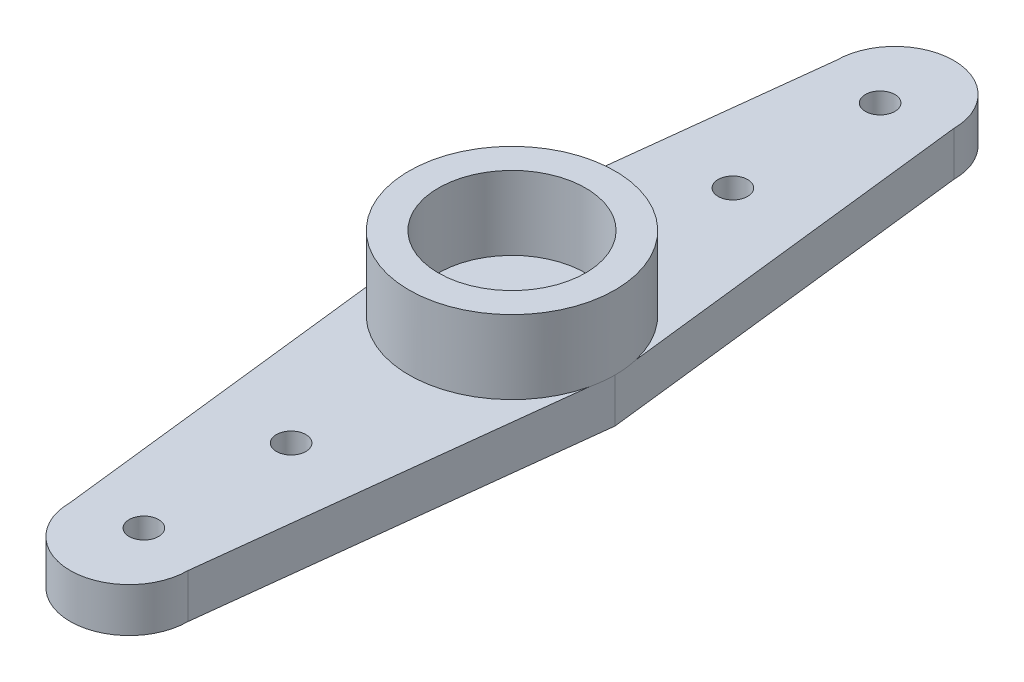
ISO-10303-21;
HEADER;
FILE_DESCRIPTION(('STEP AP214'),'2;1');
FILE_NAME('part.step','',(''),(''),'','','');
FILE_SCHEMA(('AUTOMOTIVE_DESIGN { 1 0 10303 214 1 1 1 1 }'));
ENDSEC;
DATA;
#1=APPLICATION_CONTEXT('core data for automotive mechanical design processes');
#2=APPLICATION_PROTOCOL_DEFINITION('international standard','automotive_design',2000,#1);
#3=PRODUCT_CONTEXT('',#1,'mechanical');
#4=PRODUCT('Part','Part','',(#3));
#5=PRODUCT_RELATED_PRODUCT_CATEGORY('part','',(#4));
#6=PRODUCT_DEFINITION_FORMATION('','',#4);
#7=PRODUCT_DEFINITION_CONTEXT('part definition',#1,'design');
#8=PRODUCT_DEFINITION('design','',#6,#7);
#9=PRODUCT_DEFINITION_SHAPE('','',#8);
#10=(LENGTH_UNIT() NAMED_UNIT(*) SI_UNIT(.MILLI.,.METRE.));
#11=(NAMED_UNIT(*) PLANE_ANGLE_UNIT() SI_UNIT($,.RADIAN.));
#12=(NAMED_UNIT(*) SI_UNIT($,.STERADIAN.) SOLID_ANGLE_UNIT());
#13=UNCERTAINTY_MEASURE_WITH_UNIT(LENGTH_MEASURE(1.E-05),#10,'distance_accuracy_value','');
#14=(GEOMETRIC_REPRESENTATION_CONTEXT(3) GLOBAL_UNCERTAINTY_ASSIGNED_CONTEXT((#13)) GLOBAL_UNIT_ASSIGNED_CONTEXT((#10,
#11,#12)) REPRESENTATION_CONTEXT('',''));
#15=CARTESIAN_POINT('',(0.,0.,0.));
#16=DIRECTION('',(0.,0.,1.));
#17=DIRECTION('',(1.,0.,0.));
#18=AXIS2_PLACEMENT_3D('',#15,#16,#17);
#19=CARTESIAN_POINT('',(0.,1.5,0.));
#20=DIRECTION('',(0.,1.,0.));
#21=DIRECTION('',(0.,0.,1.));
#22=AXIS2_PLACEMENT_3D('',#19,#20,#21);
#23=PLANE('',#22);
#24=CARTESIAN_POINT('',(0.,1.5,-12.5));
#25=DIRECTION('',(0.,-1.,0.));
#26=DIRECTION('',(0.,0.,-1.));
#27=AXIS2_PLACEMENT_3D('',#24,#25,#26);
#28=CIRCLE('',#27,0.500000000000001);
#29=CARTESIAN_POINT('',(0.,1.5,-13.));
#30=VERTEX_POINT('',#29);
#31=EDGE_CURVE('E162',#30,#30,#28,.T.);
#32=ORIENTED_EDGE('',*,*,#31,.T.);
#33=EDGE_LOOP('',(#32));
#34=FACE_BOUND('',#33,.T.);
#35=CARTESIAN_POINT('',(0.,1.5,-7.5));
#36=DIRECTION('',(0.,-1.,0.));
#37=DIRECTION('',(0.,0.,-1.));
#38=AXIS2_PLACEMENT_3D('',#35,#36,#37);
#39=CIRCLE('',#38,0.500000000000001);
#40=CARTESIAN_POINT('',(0.,1.5,-8.));
#41=VERTEX_POINT('',#40);
#42=EDGE_CURVE('E156',#41,#41,#39,.T.);
#43=ORIENTED_EDGE('',*,*,#42,.T.);
#44=EDGE_LOOP('',(#43));
#45=FACE_BOUND('',#44,.T.);
#46=CARTESIAN_POINT('',(0.,1.5,0.));
#47=DIRECTION('',(0.,1.,0.));
#48=DIRECTION('',(0.,0.,1.));
#49=AXIS2_PLACEMENT_3D('',#46,#47,#48);
#50=CIRCLE('',#49,3.5);
#51=CARTESIAN_POINT('',(3.40802919708029,1.5,-0.797080291970805));
#52=VERTEX_POINT('',#51);
#53=CARTESIAN_POINT('',(-3.40802919708029,1.5,-0.797080291970805));
#54=VERTEX_POINT('',#53);
#55=EDGE_CURVE('E11',#52,#54,#50,.T.);
#56=ORIENTED_EDGE('',*,*,#55,.F.);
#57=DIRECTION('',(-0.114624107985131,0.,-0.993408935871131));
#58=VECTOR('',#57,1.);
#59=CARTESIAN_POINT('',(3.45401459854015,1.5,-0.398540145985401));
#60=LINE('',#59,#58);
#61=CARTESIAN_POINT('',(2.,1.5,-13.));
#62=VERTEX_POINT('',#61);
#63=EDGE_CURVE('E218',#52,#62,#60,.T.);
#64=ORIENTED_EDGE('',*,*,#63,.T.);
#65=CARTESIAN_POINT('',(0.,1.5,-13.));
#66=DIRECTION('',(0.,1.,0.));
#67=DIRECTION('',(0.,0.,1.));
#68=AXIS2_PLACEMENT_3D('',#65,#66,#67);
#69=CIRCLE('',#68,2.);
#70=CARTESIAN_POINT('',(-2.,1.5,-13.));
#71=VERTEX_POINT('',#70);
#72=EDGE_CURVE('E238',#62,#71,#69,.T.);
#73=ORIENTED_EDGE('',*,*,#72,.T.);
#74=DIRECTION('',(-0.114624107985131,0.,0.993408935871131));
#75=VECTOR('',#74,1.);
#76=CARTESIAN_POINT('',(-3.45401459854015,1.5,-0.398540145985401));
#77=LINE('',#76,#75);
#78=EDGE_CURVE('E245',#71,#54,#77,.T.);
#79=ORIENTED_EDGE('',*,*,#78,.T.);
#80=EDGE_LOOP('',(#56,#64,#73,#79));
#81=FACE_BOUND('',#80,.T.);
#82=ADVANCED_FACE('F36',(#34,#45,#81),#23,.T.);
#83=CARTESIAN_POINT('',(3.45401459854015,1.5,-0.398540145985401));
#84=DIRECTION('',(-0.993408935871131,0.,0.114624107985131));
#85=DIRECTION('',(0.114624107985131,0.,0.993408935871131));
#86=AXIS2_PLACEMENT_3D('',#83,#84,#85);
#87=PLANE('',#86);
#88=DIRECTION('',(-0.114624107985131,0.,-0.993408935871131));
#89=VECTOR('',#88,1.);
#90=CARTESIAN_POINT('',(3.45401459854015,0.,-0.398540145985401));
#91=LINE('',#90,#89);
#92=CARTESIAN_POINT('',(3.5,0.,0.));
#93=VERTEX_POINT('',#92);
#94=CARTESIAN_POINT('',(2.,0.,-13.));
#95=VERTEX_POINT('',#94);
#96=EDGE_CURVE('E133',#93,#95,#91,.T.);
#97=ORIENTED_EDGE('',*,*,#96,.T.);
#98=DIRECTION('',(0.,-1.,0.));
#99=VECTOR('',#98,1.);
#100=CARTESIAN_POINT('',(2.,1.5,-13.));
#101=LINE('',#100,#99);
#102=EDGE_CURVE('E40',#62,#95,#101,.T.);
#103=ORIENTED_EDGE('',*,*,#102,.F.);
#104=ORIENTED_EDGE('',*,*,#63,.F.);
#105=CARTESIAN_POINT('',(3.5,1.5,0.));
#106=VERTEX_POINT('',#105);
#107=EDGE_CURVE('E221',#106,#52,#60,.T.);
#108=ORIENTED_EDGE('',*,*,#107,.F.);
#109=DIRECTION('',(0.,-1.,0.));
#110=VECTOR('',#109,1.);
#111=CARTESIAN_POINT('',(3.5,1.5,0.));
#112=LINE('',#111,#110);
#113=EDGE_CURVE('E111',#106,#93,#112,.T.);
#114=ORIENTED_EDGE('',*,*,#113,.T.);
#115=EDGE_LOOP('',(#97,#103,#104,#108,#114));
#116=FACE_BOUND('',#115,.T.);
#117=ADVANCED_FACE('F38',(#116),#87,.F.);
#118=CARTESIAN_POINT('',(0.,1.5,-13.));
#119=DIRECTION('',(0.,-1.,0.));
#120=DIRECTION('',(0.,0.,-1.));
#121=AXIS2_PLACEMENT_3D('',#118,#119,#120);
#122=CYLINDRICAL_SURFACE('',#121,2.);
#123=CARTESIAN_POINT('',(0.,0.,-13.));
#124=DIRECTION('',(0.,1.,0.));
#125=DIRECTION('',(0.,0.,1.));
#126=AXIS2_PLACEMENT_3D('',#123,#124,#125);
#127=CIRCLE('',#126,2.);
#128=CARTESIAN_POINT('',(-2.,0.,-13.));
#129=VERTEX_POINT('',#128);
#130=EDGE_CURVE('E211',#95,#129,#127,.T.);
#131=ORIENTED_EDGE('',*,*,#130,.T.);
#132=DIRECTION('',(0.,-1.,0.));
#133=VECTOR('',#132,1.);
#134=CARTESIAN_POINT('',(-2.,1.5,-13.));
#135=LINE('',#134,#133);
#136=EDGE_CURVE('E231',#71,#129,#135,.T.);
#137=ORIENTED_EDGE('',*,*,#136,.F.);
#138=ORIENTED_EDGE('',*,*,#72,.F.);
#139=ORIENTED_EDGE('',*,*,#102,.T.);
#140=EDGE_LOOP('',(#131,#137,#138,#139));
#141=FACE_BOUND('',#140,.T.);
#142=ADVANCED_FACE('F237',(#141),#122,.T.);
#143=CARTESIAN_POINT('',(-3.45401459854015,1.5,-0.398540145985401));
#144=DIRECTION('',(0.993408935871131,0.,0.114624107985131));
#145=DIRECTION('',(0.114624107985131,0.,-0.993408935871131));
#146=AXIS2_PLACEMENT_3D('',#143,#144,#145);
#147=PLANE('',#146);
#148=DIRECTION('',(-0.114624107985131,0.,0.993408935871131));
#149=VECTOR('',#148,1.);
#150=CARTESIAN_POINT('',(-3.45401459854015,0.,-0.398540145985401));
#151=LINE('',#150,#149);
#152=CARTESIAN_POINT('',(-3.5,0.,0.));
#153=VERTEX_POINT('',#152);
#154=EDGE_CURVE('E259',#129,#153,#151,.T.);
#155=ORIENTED_EDGE('',*,*,#154,.T.);
#156=DIRECTION('',(0.,-1.,0.));
#157=VECTOR('',#156,1.);
#158=CARTESIAN_POINT('',(-3.5,1.5,0.));
#159=LINE('',#158,#157);
#160=CARTESIAN_POINT('',(-3.5,1.5,0.));
#161=VERTEX_POINT('',#160);
#162=EDGE_CURVE('E230',#161,#153,#159,.T.);
#163=ORIENTED_EDGE('',*,*,#162,.F.);
#164=EDGE_CURVE('E61',#54,#161,#77,.T.);
#165=ORIENTED_EDGE('',*,*,#164,.F.);
#166=ORIENTED_EDGE('',*,*,#78,.F.);
#167=ORIENTED_EDGE('',*,*,#136,.T.);
#168=EDGE_LOOP('',(#155,#163,#165,#166,#167));
#169=FACE_BOUND('',#168,.T.);
#170=ADVANCED_FACE('F263',(#169),#147,.F.);
#171=CARTESIAN_POINT('',(-3.45401459854015,1.5,0.398540145985401));
#172=DIRECTION('',(-0.993408935871131,0.,0.114624107985131));
#173=DIRECTION('',(0.114624107985131,0.,0.993408935871131));
#174=AXIS2_PLACEMENT_3D('',#171,#172,#173);
#175=PLANE('',#174);
#176=DIRECTION('',(-0.114624107985131,0.,-0.993408935871131));
#177=VECTOR('',#176,1.);
#178=CARTESIAN_POINT('',(-3.45401459854015,0.,0.398540145985401));
#179=LINE('',#178,#177);
#180=CARTESIAN_POINT('',(-2.,0.,13.));
#181=VERTEX_POINT('',#180);
#182=EDGE_CURVE('E222',#181,#153,#179,.T.);
#183=ORIENTED_EDGE('',*,*,#182,.F.);
#184=DIRECTION('',(0.,-1.,0.));
#185=VECTOR('',#184,1.);
#186=CARTESIAN_POINT('',(-2.,1.5,13.));
#187=LINE('',#186,#185);
#188=CARTESIAN_POINT('',(-2.,1.5,13.));
#189=VERTEX_POINT('',#188);
#190=EDGE_CURVE('E228',#189,#181,#187,.T.);
#191=ORIENTED_EDGE('',*,*,#190,.F.);
#192=DIRECTION('',(-0.114624107985131,0.,-0.993408935871131));
#193=VECTOR('',#192,1.);
#194=CARTESIAN_POINT('',(-3.45401459854015,1.5,0.398540145985401));
#195=LINE('',#194,#193);
#196=CARTESIAN_POINT('',(-3.40802919708029,1.5,0.797080291970805));
#197=VERTEX_POINT('',#196);
#198=EDGE_CURVE('E253',#189,#197,#195,.T.);
#199=ORIENTED_EDGE('',*,*,#198,.T.);
#200=EDGE_CURVE('E246',#197,#161,#195,.T.);
#201=ORIENTED_EDGE('',*,*,#200,.T.);
#202=ORIENTED_EDGE('',*,*,#162,.T.);
#203=EDGE_LOOP('',(#183,#191,#199,#201,#202));
#204=FACE_BOUND('',#203,.T.);
#205=ADVANCED_FACE('F262',(#204),#175,.T.);
#206=CARTESIAN_POINT('',(0.,1.5,13.));
#207=DIRECTION('',(0.,-1.,0.));
#208=DIRECTION('',(0.,0.,-1.));
#209=AXIS2_PLACEMENT_3D('',#206,#207,#208);
#210=CYLINDRICAL_SURFACE('',#209,2.);
#211=CARTESIAN_POINT('',(0.,0.,13.));
#212=DIRECTION('',(0.,1.,0.));
#213=DIRECTION('',(0.,0.,1.));
#214=AXIS2_PLACEMENT_3D('',#211,#212,#213);
#215=CIRCLE('',#214,2.);
#216=CARTESIAN_POINT('',(2.,0.,13.));
#217=VERTEX_POINT('',#216);
#218=EDGE_CURVE('E219',#217,#181,#215,.F.);
#219=ORIENTED_EDGE('',*,*,#218,.F.);
#220=DIRECTION('',(0.,-1.,0.));
#221=VECTOR('',#220,1.);
#222=CARTESIAN_POINT('',(2.,1.5,13.));
#223=LINE('',#222,#221);
#224=CARTESIAN_POINT('',(2.,1.5,13.));
#225=VERTEX_POINT('',#224);
#226=EDGE_CURVE('E216',#225,#217,#223,.T.);
#227=ORIENTED_EDGE('',*,*,#226,.F.);
#228=CARTESIAN_POINT('',(0.,1.5,13.));
#229=DIRECTION('',(0.,1.,0.));
#230=DIRECTION('',(0.,0.,1.));
#231=AXIS2_PLACEMENT_3D('',#228,#229,#230);
#232=CIRCLE('',#231,2.);
#233=EDGE_CURVE('E120',#225,#189,#232,.F.);
#234=ORIENTED_EDGE('',*,*,#233,.T.);
#235=ORIENTED_EDGE('',*,*,#190,.T.);
#236=EDGE_LOOP('',(#219,#227,#234,#235));
#237=FACE_BOUND('',#236,.T.);
#238=ADVANCED_FACE('F270',(#237),#210,.T.);
#239=CARTESIAN_POINT('',(3.45401459854015,1.5,0.398540145985401));
#240=DIRECTION('',(0.993408935871131,0.,0.114624107985131));
#241=DIRECTION('',(0.114624107985131,0.,-0.993408935871131));
#242=AXIS2_PLACEMENT_3D('',#239,#240,#241);
#243=PLANE('',#242);
#244=DIRECTION('',(-0.114624107985131,0.,0.993408935871131));
#245=VECTOR('',#244,1.);
#246=CARTESIAN_POINT('',(3.45401459854015,0.,0.398540145985401));
#247=LINE('',#246,#245);
#248=EDGE_CURVE('E209',#93,#217,#247,.T.);
#249=ORIENTED_EDGE('',*,*,#248,.F.);
#250=ORIENTED_EDGE('',*,*,#113,.F.);
#251=DIRECTION('',(-0.114624107985131,0.,0.993408935871131));
#252=VECTOR('',#251,1.);
#253=CARTESIAN_POINT('',(3.45401459854015,1.5,0.398540145985401));
#254=LINE('',#253,#252);
#255=CARTESIAN_POINT('',(3.40802919708029,1.5,0.797080291970804));
#256=VERTEX_POINT('',#255);
#257=EDGE_CURVE('E106',#106,#256,#254,.T.);
#258=ORIENTED_EDGE('',*,*,#257,.T.);
#259=EDGE_CURVE('E109',#256,#225,#254,.T.);
#260=ORIENTED_EDGE('',*,*,#259,.T.);
#261=ORIENTED_EDGE('',*,*,#226,.T.);
#262=EDGE_LOOP('',(#249,#250,#258,#260,#261));
#263=FACE_BOUND('',#262,.T.);
#264=ADVANCED_FACE('F108',(#263),#243,.T.);
#265=CARTESIAN_POINT('',(0.,1.5,7.5));
#266=DIRECTION('',(0.,-1.,0.));
#267=DIRECTION('',(0.,0.,1.));
#268=AXIS2_PLACEMENT_3D('',#265,#266,#267);
#269=CIRCLE('',#268,0.500000000000001);
#270=CARTESIAN_POINT('',(0.,1.5,8.));
#271=VERTEX_POINT('',#270);
#272=EDGE_CURVE('E174',#271,#271,#269,.T.);
#273=ORIENTED_EDGE('',*,*,#272,.T.);
#274=EDGE_LOOP('',(#273));
#275=FACE_BOUND('',#274,.T.);
#276=CARTESIAN_POINT('',(0.,1.5,12.5));
#277=DIRECTION('',(0.,-1.,0.));
#278=DIRECTION('',(0.,0.,1.));
#279=AXIS2_PLACEMENT_3D('',#276,#277,#278);
#280=CIRCLE('',#279,0.500000000000001);
#281=CARTESIAN_POINT('',(0.,1.5,13.));
#282=VERTEX_POINT('',#281);
#283=EDGE_CURVE('E168',#282,#282,#280,.T.);
#284=ORIENTED_EDGE('',*,*,#283,.T.);
#285=EDGE_LOOP('',(#284));
#286=FACE_BOUND('',#285,.T.);
#287=EDGE_CURVE('E45',#197,#256,#50,.T.);
#288=ORIENTED_EDGE('',*,*,#287,.F.);
#289=ORIENTED_EDGE('',*,*,#198,.F.);
#290=ORIENTED_EDGE('',*,*,#233,.F.);
#291=ORIENTED_EDGE('',*,*,#259,.F.);
#292=EDGE_LOOP('',(#288,#289,#290,#291));
#293=FACE_BOUND('',#292,.T.);
#294=ADVANCED_FACE('F118',(#275,#286,#293),#23,.T.);
#295=CARTESIAN_POINT('',(0.,0.,0.));
#296=DIRECTION('',(0.,1.,0.));
#297=DIRECTION('',(0.,0.,1.));
#298=AXIS2_PLACEMENT_3D('',#295,#296,#297);
#299=PLANE('',#298);
#300=CARTESIAN_POINT('',(0.,0.,7.5));
#301=DIRECTION('',(0.,-1.,0.));
#302=DIRECTION('',(0.,0.,1.));
#303=AXIS2_PLACEMENT_3D('',#300,#301,#302);
#304=CIRCLE('',#303,0.500000000000001);
#305=CARTESIAN_POINT('',(0.,0.,8.));
#306=VERTEX_POINT('',#305);
#307=EDGE_CURVE('E177',#306,#306,#304,.T.);
#308=ORIENTED_EDGE('',*,*,#307,.F.);
#309=EDGE_LOOP('',(#308));
#310=FACE_BOUND('',#309,.T.);
#311=CARTESIAN_POINT('',(0.,0.,12.5));
#312=DIRECTION('',(0.,-1.,0.));
#313=DIRECTION('',(0.,0.,1.));
#314=AXIS2_PLACEMENT_3D('',#311,#312,#313);
#315=CIRCLE('',#314,0.500000000000001);
#316=CARTESIAN_POINT('',(0.,0.,13.));
#317=VERTEX_POINT('',#316);
#318=EDGE_CURVE('E171',#317,#317,#315,.T.);
#319=ORIENTED_EDGE('',*,*,#318,.F.);
#320=EDGE_LOOP('',(#319));
#321=FACE_BOUND('',#320,.T.);
#322=CARTESIAN_POINT('',(0.,0.,-12.5));
#323=DIRECTION('',(0.,-1.,0.));
#324=DIRECTION('',(0.,0.,-1.));
#325=AXIS2_PLACEMENT_3D('',#322,#323,#324);
#326=CIRCLE('',#325,0.500000000000001);
#327=CARTESIAN_POINT('',(0.,0.,-13.));
#328=VERTEX_POINT('',#327);
#329=EDGE_CURVE('E165',#328,#328,#326,.T.);
#330=ORIENTED_EDGE('',*,*,#329,.F.);
#331=EDGE_LOOP('',(#330));
#332=FACE_BOUND('',#331,.T.);
#333=CARTESIAN_POINT('',(0.,0.,-7.5));
#334=DIRECTION('',(0.,-1.,0.));
#335=DIRECTION('',(0.,0.,-1.));
#336=AXIS2_PLACEMENT_3D('',#333,#334,#335);
#337=CIRCLE('',#336,0.500000000000001);
#338=CARTESIAN_POINT('',(0.,0.,-8.));
#339=VERTEX_POINT('',#338);
#340=EDGE_CURVE('E159',#339,#339,#337,.T.);
#341=ORIENTED_EDGE('',*,*,#340,.F.);
#342=EDGE_LOOP('',(#341));
#343=FACE_BOUND('',#342,.T.);
#344=CARTESIAN_POINT('',(0.,0.,0.));
#345=DIRECTION('',(0.,-1.,0.));
#346=DIRECTION('',(0.,0.,-1.));
#347=AXIS2_PLACEMENT_3D('',#344,#345,#346);
#348=CIRCLE('',#347,2.25);
#349=CARTESIAN_POINT('',(0.,0.,-2.25));
#350=VERTEX_POINT('',#349);
#351=EDGE_CURVE('E147',#350,#350,#348,.T.);
#352=ORIENTED_EDGE('',*,*,#351,.F.);
#353=EDGE_LOOP('',(#352));
#354=FACE_BOUND('',#353,.T.);
#355=ORIENTED_EDGE('',*,*,#96,.F.);
#356=ORIENTED_EDGE('',*,*,#248,.T.);
#357=ORIENTED_EDGE('',*,*,#218,.T.);
#358=ORIENTED_EDGE('',*,*,#182,.T.);
#359=ORIENTED_EDGE('',*,*,#154,.F.);
#360=ORIENTED_EDGE('',*,*,#130,.F.);
#361=EDGE_LOOP('',(#355,#356,#357,#358,#359,#360));
#362=FACE_BOUND('',#361,.T.);
#363=ADVANCED_FACE('F192',(#310,#321,#332,#343,#354,#362),#299,.F.);
#364=CARTESIAN_POINT('',(0.,1.5,0.));
#365=DIRECTION('',(0.,1.,0.));
#366=DIRECTION('',(0.,0.,1.));
#367=AXIS2_PLACEMENT_3D('',#364,#365,#366);
#368=PLANE('',#367);
#369=EDGE_CURVE('E135',#54,#161,#50,.T.);
#370=ORIENTED_EDGE('',*,*,#369,.F.);
#371=ORIENTED_EDGE('',*,*,#164,.T.);
#372=EDGE_LOOP('',(#370,#371));
#373=FACE_BOUND('',#372,.T.);
#374=ADVANCED_FACE('F195',(#373),#368,.F.);
#375=EDGE_CURVE('E47',#106,#52,#50,.T.);
#376=ORIENTED_EDGE('',*,*,#375,.F.);
#377=ORIENTED_EDGE('',*,*,#107,.T.);
#378=EDGE_LOOP('',(#376,#377));
#379=FACE_BOUND('',#378,.T.);
#380=ADVANCED_FACE('F243',(#379),#368,.F.);
#381=ORIENTED_EDGE('',*,*,#200,.F.);
#382=EDGE_CURVE('E129',#161,#197,#50,.T.);
#383=ORIENTED_EDGE('',*,*,#382,.F.);
#384=EDGE_LOOP('',(#381,#383));
#385=FACE_BOUND('',#384,.T.);
#386=ADVANCED_FACE('F251',(#385),#368,.F.);
#387=CARTESIAN_POINT('',(0.,4.,0.));
#388=DIRECTION('',(0.,-1.,0.));
#389=DIRECTION('',(0.,0.,-1.));
#390=AXIS2_PLACEMENT_3D('',#387,#388,#389);
#391=CYLINDRICAL_SURFACE('',#390,3.5);
#392=CARTESIAN_POINT('',(0.,4.,0.));
#393=DIRECTION('',(0.,1.,0.));
#394=DIRECTION('',(0.,0.,1.));
#395=AXIS2_PLACEMENT_3D('',#392,#393,#394);
#396=CIRCLE('',#395,3.5);
#397=CARTESIAN_POINT('',(0.,4.,3.5));
#398=VERTEX_POINT('',#397);
#399=EDGE_CURVE('E131',#398,#398,#396,.T.);
#400=ORIENTED_EDGE('',*,*,#399,.F.);
#401=EDGE_LOOP('',(#400));
#402=FACE_BOUND('',#401,.T.);
#403=EDGE_CURVE('E126',#256,#106,#50,.T.);
#404=ORIENTED_EDGE('',*,*,#403,.T.);
#405=ORIENTED_EDGE('',*,*,#375,.T.);
#406=ORIENTED_EDGE('',*,*,#55,.T.);
#407=ORIENTED_EDGE('',*,*,#369,.T.);
#408=ORIENTED_EDGE('',*,*,#382,.T.);
#409=ORIENTED_EDGE('',*,*,#287,.T.);
#410=EDGE_LOOP('',(#404,#405,#406,#407,#408,#409));
#411=FACE_BOUND('',#410,.T.);
#412=ADVANCED_FACE('F124',(#402,#411),#391,.T.);
#413=CARTESIAN_POINT('',(0.,4.,0.));
#414=DIRECTION('',(0.,1.,0.));
#415=DIRECTION('',(0.,0.,1.));
#416=AXIS2_PLACEMENT_3D('',#413,#414,#415);
#417=PLANE('',#416);
#418=CARTESIAN_POINT('',(0.,4.,0.));
#419=DIRECTION('',(0.,1.,0.));
#420=DIRECTION('',(0.,0.,1.));
#421=AXIS2_PLACEMENT_3D('',#418,#419,#420);
#422=CIRCLE('',#421,2.5);
#423=CARTESIAN_POINT('',(0.,4.,2.5));
#424=VERTEX_POINT('',#423);
#425=EDGE_CURVE('E139',#424,#424,#422,.T.);
#426=ORIENTED_EDGE('',*,*,#425,.F.);
#427=EDGE_LOOP('',(#426));
#428=FACE_BOUND('',#427,.T.);
#429=ORIENTED_EDGE('',*,*,#399,.T.);
#430=EDGE_LOOP('',(#429));
#431=FACE_BOUND('',#430,.T.);
#432=ADVANCED_FACE('F337',(#428,#431),#417,.T.);
#433=ORIENTED_EDGE('',*,*,#257,.F.);
#434=ORIENTED_EDGE('',*,*,#403,.F.);
#435=EDGE_LOOP('',(#433,#434));
#436=FACE_BOUND('',#435,.T.);
#437=ADVANCED_FACE('F130',(#436),#368,.F.);
#438=CARTESIAN_POINT('',(0.,1.5,0.));
#439=DIRECTION('',(0.,1.,0.));
#440=DIRECTION('',(0.,0.,1.));
#441=AXIS2_PLACEMENT_3D('',#438,#439,#440);
#442=CYLINDRICAL_SURFACE('',#441,2.5);
#443=CARTESIAN_POINT('',(0.,1.5,0.));
#444=DIRECTION('',(0.,1.,0.));
#445=DIRECTION('',(0.,0.,1.));
#446=AXIS2_PLACEMENT_3D('',#443,#444,#445);
#447=CIRCLE('',#446,2.5);
#448=CARTESIAN_POINT('',(0.,1.5,2.5));
#449=VERTEX_POINT('',#448);
#450=EDGE_CURVE('E137',#449,#449,#447,.T.);
#451=ORIENTED_EDGE('',*,*,#450,.F.);
#452=EDGE_LOOP('',(#451));
#453=FACE_BOUND('',#452,.T.);
#454=ORIENTED_EDGE('',*,*,#425,.T.);
#455=EDGE_LOOP('',(#454));
#456=FACE_BOUND('',#455,.T.);
#457=ADVANCED_FACE('F348',(#453,#456),#442,.F.);
#458=CARTESIAN_POINT('',(0.,1.5,0.));
#459=DIRECTION('',(0.,1.,0.));
#460=DIRECTION('',(0.,0.,1.));
#461=AXIS2_PLACEMENT_3D('',#458,#459,#460);
#462=PLANE('',#461);
#463=CARTESIAN_POINT('',(0.,1.5,0.));
#464=DIRECTION('',(0.,-1.,0.));
#465=DIRECTION('',(0.,0.,-1.));
#466=AXIS2_PLACEMENT_3D('',#463,#464,#465);
#467=CIRCLE('',#466,0.9);
#468=CARTESIAN_POINT('',(0.,1.5,-0.9));
#469=VERTEX_POINT('',#468);
#470=EDGE_CURVE('E150',#469,#469,#467,.T.);
#471=ORIENTED_EDGE('',*,*,#470,.T.);
#472=EDGE_LOOP('',(#471));
#473=FACE_BOUND('',#472,.T.);
#474=ORIENTED_EDGE('',*,*,#450,.T.);
#475=EDGE_LOOP('',(#474));
#476=FACE_BOUND('',#475,.T.);
#477=ADVANCED_FACE('F363',(#473,#476),#462,.T.);
#478=CARTESIAN_POINT('',(0.,0.5,0.));
#479=DIRECTION('',(0.,-1.,0.));
#480=DIRECTION('',(0.,0.,-1.));
#481=AXIS2_PLACEMENT_3D('',#478,#479,#480);
#482=CYLINDRICAL_SURFACE('',#481,2.25);
#483=CARTESIAN_POINT('',(0.,0.5,0.));
#484=DIRECTION('',(0.,-1.,0.));
#485=DIRECTION('',(0.,0.,-1.));
#486=AXIS2_PLACEMENT_3D('',#483,#484,#485);
#487=CIRCLE('',#486,2.25);
#488=CARTESIAN_POINT('',(0.,0.5,-2.25));
#489=VERTEX_POINT('',#488);
#490=EDGE_CURVE('E144',#489,#489,#487,.T.);
#491=ORIENTED_EDGE('',*,*,#490,.F.);
#492=EDGE_LOOP('',(#491));
#493=FACE_BOUND('',#492,.T.);
#494=ORIENTED_EDGE('',*,*,#351,.T.);
#495=EDGE_LOOP('',(#494));
#496=FACE_BOUND('',#495,.T.);
#497=ADVANCED_FACE('F371',(#493,#496),#482,.F.);
#498=CARTESIAN_POINT('',(0.,0.5,0.));
#499=DIRECTION('',(0.,-1.,0.));
#500=DIRECTION('',(0.,0.,-1.));
#501=AXIS2_PLACEMENT_3D('',#498,#499,#500);
#502=PLANE('',#501);
#503=CARTESIAN_POINT('',(0.,0.5,0.));
#504=DIRECTION('',(0.,-1.,0.));
#505=DIRECTION('',(0.,0.,-1.));
#506=AXIS2_PLACEMENT_3D('',#503,#504,#505);
#507=CIRCLE('',#506,0.9);
#508=CARTESIAN_POINT('',(0.,0.5,-0.9));
#509=VERTEX_POINT('',#508);
#510=EDGE_CURVE('E153',#509,#509,#507,.T.);
#511=ORIENTED_EDGE('',*,*,#510,.F.);
#512=EDGE_LOOP('',(#511));
#513=FACE_BOUND('',#512,.T.);
#514=ORIENTED_EDGE('',*,*,#490,.T.);
#515=EDGE_LOOP('',(#514));
#516=FACE_BOUND('',#515,.T.);
#517=ADVANCED_FACE('F376',(#513,#516),#502,.T.);
#518=CARTESIAN_POINT('',(0.,1.5,0.));
#519=DIRECTION('',(0.,-1.,0.));
#520=DIRECTION('',(0.,0.,-1.));
#521=AXIS2_PLACEMENT_3D('',#518,#519,#520);
#522=CYLINDRICAL_SURFACE('',#521,0.9);
#523=ORIENTED_EDGE('',*,*,#470,.F.);
#524=EDGE_LOOP('',(#523));
#525=FACE_BOUND('',#524,.T.);
#526=ORIENTED_EDGE('',*,*,#510,.T.);
#527=EDGE_LOOP('',(#526));
#528=FACE_BOUND('',#527,.T.);
#529=ADVANCED_FACE('F393',(#525,#528),#522,.F.);
#530=CARTESIAN_POINT('',(0.,1.5,-7.5));
#531=DIRECTION('',(0.,-1.,0.));
#532=DIRECTION('',(0.,0.,-1.));
#533=AXIS2_PLACEMENT_3D('',#530,#531,#532);
#534=CYLINDRICAL_SURFACE('',#533,0.500000000000001);
#535=ORIENTED_EDGE('',*,*,#42,.F.);
#536=EDGE_LOOP('',(#535));
#537=FACE_BOUND('',#536,.T.);
#538=ORIENTED_EDGE('',*,*,#340,.T.);
#539=EDGE_LOOP('',(#538));
#540=FACE_BOUND('',#539,.T.);
#541=ADVANCED_FACE('F402',(#537,#540),#534,.F.);
#542=CARTESIAN_POINT('',(0.,1.5,-12.5));
#543=DIRECTION('',(0.,-1.,0.));
#544=DIRECTION('',(0.,0.,-1.));
#545=AXIS2_PLACEMENT_3D('',#542,#543,#544);
#546=CYLINDRICAL_SURFACE('',#545,0.500000000000001);
#547=ORIENTED_EDGE('',*,*,#31,.F.);
#548=EDGE_LOOP('',(#547));
#549=FACE_BOUND('',#548,.T.);
#550=ORIENTED_EDGE('',*,*,#329,.T.);
#551=EDGE_LOOP('',(#550));
#552=FACE_BOUND('',#551,.T.);
#553=ADVANCED_FACE('F431',(#549,#552),#546,.F.);
#554=CARTESIAN_POINT('',(0.,1.5,12.5));
#555=DIRECTION('',(0.,-1.,0.));
#556=DIRECTION('',(0.,0.,-1.));
#557=AXIS2_PLACEMENT_3D('',#554,#555,#556);
#558=CYLINDRICAL_SURFACE('',#557,0.500000000000001);
#559=ORIENTED_EDGE('',*,*,#283,.F.);
#560=EDGE_LOOP('',(#559));
#561=FACE_BOUND('',#560,.T.);
#562=ORIENTED_EDGE('',*,*,#318,.T.);
#563=EDGE_LOOP('',(#562));
#564=FACE_BOUND('',#563,.T.);
#565=ADVANCED_FACE('F188',(#561,#564),#558,.F.);
#566=CARTESIAN_POINT('',(0.,1.5,7.5));
#567=DIRECTION('',(0.,-1.,0.));
#568=DIRECTION('',(0.,0.,-1.));
#569=AXIS2_PLACEMENT_3D('',#566,#567,#568);
#570=CYLINDRICAL_SURFACE('',#569,0.500000000000001);
#571=ORIENTED_EDGE('',*,*,#272,.F.);
#572=EDGE_LOOP('',(#571));
#573=FACE_BOUND('',#572,.T.);
#574=ORIENTED_EDGE('',*,*,#307,.T.);
#575=EDGE_LOOP('',(#574));
#576=FACE_BOUND('',#575,.T.);
#577=ADVANCED_FACE('F185',(#573,#576),#570,.F.);
#578=CLOSED_SHELL('',(#82,#117,#142,#170,#205,#238,#264,#294,#363,#374,#380,#386,#412,#432,#437,
#457,#477,#497,#517,#529,#541,#553,#565,#577));
#579=MANIFOLD_SOLID_BREP('B2',#578);
#580=ADVANCED_BREP_SHAPE_REPRESENTATION('',(#18,#579),#14);
#581=SHAPE_DEFINITION_REPRESENTATION(#9,#580);
ENDSEC;
END-ISO-10303-21;
